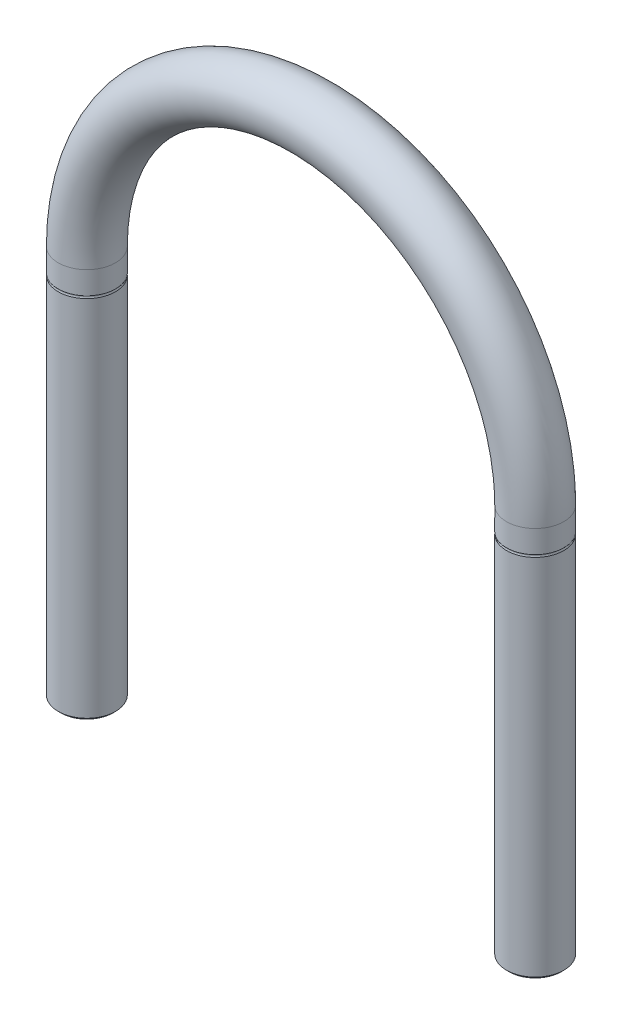
ISO-10303-21;
HEADER;
FILE_DESCRIPTION(('STEP AP214'),'2;1');
FILE_NAME('part.step','',(''),(''),'','','');
FILE_SCHEMA(('AUTOMOTIVE_DESIGN { 1 0 10303 214 1 1 1 1 }'));
ENDSEC;
DATA;
#1=APPLICATION_CONTEXT('core data for automotive mechanical design processes');
#2=APPLICATION_PROTOCOL_DEFINITION('international standard','automotive_design',2000,#1);
#3=PRODUCT_CONTEXT('',#1,'mechanical');
#4=PRODUCT('Part','Part','',(#3));
#5=PRODUCT_RELATED_PRODUCT_CATEGORY('part','',(#4));
#6=PRODUCT_DEFINITION_FORMATION('','',#4);
#7=PRODUCT_DEFINITION_CONTEXT('part definition',#1,'design');
#8=PRODUCT_DEFINITION('design','',#6,#7);
#9=PRODUCT_DEFINITION_SHAPE('','',#8);
#10=(LENGTH_UNIT() NAMED_UNIT(*) SI_UNIT(.MILLI.,.METRE.));
#11=(NAMED_UNIT(*) PLANE_ANGLE_UNIT() SI_UNIT($,.RADIAN.));
#12=(NAMED_UNIT(*) SI_UNIT($,.STERADIAN.) SOLID_ANGLE_UNIT());
#13=UNCERTAINTY_MEASURE_WITH_UNIT(LENGTH_MEASURE(1.E-05),#10,'distance_accuracy_value','');
#14=(GEOMETRIC_REPRESENTATION_CONTEXT(3) GLOBAL_UNCERTAINTY_ASSIGNED_CONTEXT((#13)) GLOBAL_UNIT_ASSIGNED_CONTEXT((#10,
#11,#12)) REPRESENTATION_CONTEXT('',''));
#15=CARTESIAN_POINT('',(0.,0.,0.));
#16=DIRECTION('',(0.,0.,1.));
#17=DIRECTION('',(1.,0.,0.));
#18=AXIS2_PLACEMENT_3D('',#15,#16,#17);
#19=CARTESIAN_POINT('',(0.,0.,0.));
#20=DIRECTION('',(0.,0.,-1.));
#21=DIRECTION('',(0.,1.,0.));
#22=AXIS2_PLACEMENT_3D('',#19,#20,#21);
#23=TOROIDAL_SURFACE('',#22,47.,6.);
#24=CARTESIAN_POINT('',(-47.,0.,0.));
#25=DIRECTION('',(0.,1.,0.));
#26=DIRECTION('',(-1.,0.,0.));
#27=AXIS2_PLACEMENT_3D('',#24,#25,#26);
#28=CIRCLE('',#27,6.);
#29=CARTESIAN_POINT('',(-41.,0.,0.));
#30=VERTEX_POINT('',#29);
#31=EDGE_CURVE('E60',#30,#30,#28,.T.);
#32=ORIENTED_EDGE('',*,*,#31,.T.);
#33=EDGE_LOOP('',(#32));
#34=FACE_BOUND('',#33,.T.);
#35=CARTESIAN_POINT('',(47.,0.,0.));
#36=DIRECTION('',(0.,1.,0.));
#37=DIRECTION('',(1.,0.,0.));
#38=AXIS2_PLACEMENT_3D('',#35,#36,#37);
#39=CIRCLE('',#38,6.);
#40=CARTESIAN_POINT('',(41.,0.,0.));
#41=VERTEX_POINT('',#40);
#42=EDGE_CURVE('E10',#41,#41,#39,.T.);
#43=ORIENTED_EDGE('',*,*,#42,.T.);
#44=EDGE_LOOP('',(#43));
#45=FACE_BOUND('',#44,.T.);
#46=ADVANCED_FACE('F15',(#34,#45),#23,.T.);
#47=CARTESIAN_POINT('',(47.,-82.,0.));
#48=DIRECTION('',(0.,-1.,0.));
#49=DIRECTION('',(-1.,0.,0.));
#50=AXIS2_PLACEMENT_3D('',#47,#48,#49);
#51=PLANE('',#50);
#52=CARTESIAN_POINT('',(47.,-82.,0.));
#53=DIRECTION('',(0.,-1.,0.));
#54=DIRECTION('',(1.,0.,0.));
#55=AXIS2_PLACEMENT_3D('',#52,#53,#54);
#56=CIRCLE('',#55,5.45875);
#57=CARTESIAN_POINT('',(52.45875,-82.,0.));
#58=VERTEX_POINT('',#57);
#59=EDGE_CURVE('E24',#58,#58,#56,.T.);
#60=ORIENTED_EDGE('',*,*,#59,.T.);
#61=EDGE_LOOP('',(#60));
#62=FACE_BOUND('',#61,.T.);
#63=ADVANCED_FACE('F84',(#62),#51,.T.);
#64=CARTESIAN_POINT('',(47.,-41.,0.));
#65=DIRECTION('',(0.,-1.,0.));
#66=DIRECTION('',(1.,0.,0.));
#67=AXIS2_PLACEMENT_3D('',#64,#65,#66);
#68=CYLINDRICAL_SURFACE('',#67,6.);
#69=ORIENTED_EDGE('',*,*,#42,.F.);
#70=EDGE_LOOP('',(#69));
#71=FACE_BOUND('',#70,.T.);
#72=CARTESIAN_POINT('',(47.,-4.75,0.));
#73=DIRECTION('',(0.,1.,0.));
#74=DIRECTION('',(1.,0.,0.));
#75=AXIS2_PLACEMENT_3D('',#72,#73,#74);
#76=CIRCLE('',#75,6.);
#77=CARTESIAN_POINT('',(53.,-4.75,0.));
#78=VERTEX_POINT('',#77);
#79=EDGE_CURVE('E52',#78,#78,#76,.T.);
#80=ORIENTED_EDGE('',*,*,#79,.T.);
#81=EDGE_LOOP('',(#80));
#82=FACE_BOUND('',#81,.T.);
#83=ADVANCED_FACE('F74',(#71,#82),#68,.T.);
#84=CARTESIAN_POINT('',(47.,-81.729375,0.));
#85=DIRECTION('',(0.,1.,0.));
#86=DIRECTION('',(1.,0.,0.));
#87=AXIS2_PLACEMENT_3D('',#84,#85,#86);
#88=CONICAL_SURFACE('',#87,5.729375,0.785398163397448);
#89=ORIENTED_EDGE('',*,*,#59,.F.);
#90=EDGE_LOOP('',(#89));
#91=FACE_BOUND('',#90,.T.);
#92=CARTESIAN_POINT('',(47.,-81.45875,0.));
#93=DIRECTION('',(0.,1.,0.));
#94=DIRECTION('',(1.,0.,0.));
#95=AXIS2_PLACEMENT_3D('',#92,#93,#94);
#96=CIRCLE('',#95,6.);
#97=CARTESIAN_POINT('',(53.,-81.45875,0.));
#98=VERTEX_POINT('',#97);
#99=EDGE_CURVE('E55',#98,#98,#96,.T.);
#100=ORIENTED_EDGE('',*,*,#99,.F.);
#101=EDGE_LOOP('',(#100));
#102=FACE_BOUND('',#101,.T.);
#103=ADVANCED_FACE('F72',(#91,#102),#88,.T.);
#104=CARTESIAN_POINT('',(47.,-41.,0.));
#105=DIRECTION('',(0.,-1.,0.));
#106=DIRECTION('',(1.,0.,0.));
#107=AXIS2_PLACEMENT_3D('',#104,#105,#106);
#108=CYLINDRICAL_SURFACE('',#107,6.);
#109=ORIENTED_EDGE('',*,*,#99,.T.);
#110=EDGE_LOOP('',(#109));
#111=FACE_BOUND('',#110,.T.);
#112=CARTESIAN_POINT('',(47.,-5.25,0.));
#113=DIRECTION('',(0.,-1.,0.));
#114=DIRECTION('',(1.,0.,0.));
#115=AXIS2_PLACEMENT_3D('',#112,#113,#114);
#116=CIRCLE('',#115,6.);
#117=CARTESIAN_POINT('',(53.,-5.25,0.));
#118=VERTEX_POINT('',#117);
#119=EDGE_CURVE('E56',#118,#118,#116,.T.);
#120=ORIENTED_EDGE('',*,*,#119,.T.);
#121=EDGE_LOOP('',(#120));
#122=FACE_BOUND('',#121,.T.);
#123=ADVANCED_FACE('F69',(#111,#122),#108,.T.);
#124=CARTESIAN_POINT('',(47.,-5.,0.));
#125=DIRECTION('',(0.,1.,0.));
#126=DIRECTION('',(0.,0.,1.));
#127=AXIS2_PLACEMENT_3D('',#124,#125,#126);
#128=TOROIDAL_SURFACE('',#127,6.43301270189222,0.5);
#129=ORIENTED_EDGE('',*,*,#79,.F.);
#130=EDGE_LOOP('',(#129));
#131=FACE_BOUND('',#130,.T.);
#132=ORIENTED_EDGE('',*,*,#119,.F.);
#133=EDGE_LOOP('',(#132));
#134=FACE_BOUND('',#133,.T.);
#135=ADVANCED_FACE('F82',(#131,#134),#128,.F.);
#136=CARTESIAN_POINT('',(-47.,-82.,0.));
#137=DIRECTION('',(0.,-1.,0.));
#138=DIRECTION('',(-1.,0.,0.));
#139=AXIS2_PLACEMENT_3D('',#136,#137,#138);
#140=PLANE('',#139);
#141=CARTESIAN_POINT('',(-47.,-82.,0.));
#142=DIRECTION('',(0.,-1.,0.));
#143=DIRECTION('',(1.,0.,0.));
#144=AXIS2_PLACEMENT_3D('',#141,#142,#143);
#145=CIRCLE('',#144,5.45875);
#146=CARTESIAN_POINT('',(-41.54125,-82.,0.));
#147=VERTEX_POINT('',#146);
#148=EDGE_CURVE('E62',#147,#147,#145,.T.);
#149=ORIENTED_EDGE('',*,*,#148,.T.);
#150=EDGE_LOOP('',(#149));
#151=FACE_BOUND('',#150,.T.);
#152=ADVANCED_FACE('F117',(#151),#140,.T.);
#153=CARTESIAN_POINT('',(-47.,-41.,0.));
#154=DIRECTION('',(0.,-1.,0.));
#155=DIRECTION('',(1.,0.,0.));
#156=AXIS2_PLACEMENT_3D('',#153,#154,#155);
#157=CYLINDRICAL_SURFACE('',#156,6.);
#158=ORIENTED_EDGE('',*,*,#31,.F.);
#159=EDGE_LOOP('',(#158));
#160=FACE_BOUND('',#159,.T.);
#161=CARTESIAN_POINT('',(-47.,-4.75,0.));
#162=DIRECTION('',(0.,1.,0.));
#163=DIRECTION('',(1.,0.,0.));
#164=AXIS2_PLACEMENT_3D('',#161,#162,#163);
#165=CIRCLE('',#164,6.);
#166=CARTESIAN_POINT('',(-41.,-4.75,0.));
#167=VERTEX_POINT('',#166);
#168=EDGE_CURVE('E41',#167,#167,#165,.T.);
#169=ORIENTED_EDGE('',*,*,#168,.T.);
#170=EDGE_LOOP('',(#169));
#171=FACE_BOUND('',#170,.T.);
#172=ADVANCED_FACE('F110',(#160,#171),#157,.T.);
#173=CARTESIAN_POINT('',(-47.,-81.729375,0.));
#174=DIRECTION('',(0.,1.,0.));
#175=DIRECTION('',(1.,0.,0.));
#176=AXIS2_PLACEMENT_3D('',#173,#174,#175);
#177=CONICAL_SURFACE('',#176,5.729375,0.785398163397448);
#178=ORIENTED_EDGE('',*,*,#148,.F.);
#179=EDGE_LOOP('',(#178));
#180=FACE_BOUND('',#179,.T.);
#181=CARTESIAN_POINT('',(-47.,-81.45875,0.));
#182=DIRECTION('',(0.,1.,0.));
#183=DIRECTION('',(1.,0.,0.));
#184=AXIS2_PLACEMENT_3D('',#181,#182,#183);
#185=CIRCLE('',#184,6.);
#186=CARTESIAN_POINT('',(-41.,-81.45875,0.));
#187=VERTEX_POINT('',#186);
#188=EDGE_CURVE('E50',#187,#187,#185,.T.);
#189=ORIENTED_EDGE('',*,*,#188,.F.);
#190=EDGE_LOOP('',(#189));
#191=FACE_BOUND('',#190,.T.);
#192=ADVANCED_FACE('F105',(#180,#191),#177,.T.);
#193=CARTESIAN_POINT('',(-47.,-41.,0.));
#194=DIRECTION('',(0.,-1.,0.));
#195=DIRECTION('',(1.,0.,0.));
#196=AXIS2_PLACEMENT_3D('',#193,#194,#195);
#197=CYLINDRICAL_SURFACE('',#196,6.);
#198=ORIENTED_EDGE('',*,*,#188,.T.);
#199=EDGE_LOOP('',(#198));
#200=FACE_BOUND('',#199,.T.);
#201=CARTESIAN_POINT('',(-47.,-5.25,0.));
#202=DIRECTION('',(0.,-1.,0.));
#203=DIRECTION('',(1.,0.,0.));
#204=AXIS2_PLACEMENT_3D('',#201,#202,#203);
#205=CIRCLE('',#204,6.);
#206=CARTESIAN_POINT('',(-41.,-5.25,0.));
#207=VERTEX_POINT('',#206);
#208=EDGE_CURVE('E47',#207,#207,#205,.T.);
#209=ORIENTED_EDGE('',*,*,#208,.T.);
#210=EDGE_LOOP('',(#209));
#211=FACE_BOUND('',#210,.T.);
#212=ADVANCED_FACE('F17',(#200,#211),#197,.T.);
#213=CARTESIAN_POINT('',(-47.,-5.,0.));
#214=DIRECTION('',(0.,1.,0.));
#215=DIRECTION('',(0.,0.,1.));
#216=AXIS2_PLACEMENT_3D('',#213,#214,#215);
#217=TOROIDAL_SURFACE('',#216,6.43301270189222,0.5);
#218=ORIENTED_EDGE('',*,*,#168,.F.);
#219=EDGE_LOOP('',(#218));
#220=FACE_BOUND('',#219,.T.);
#221=ORIENTED_EDGE('',*,*,#208,.F.);
#222=EDGE_LOOP('',(#221));
#223=FACE_BOUND('',#222,.T.);
#224=ADVANCED_FACE('F99',(#220,#223),#217,.F.);
#225=CLOSED_SHELL('',(#46,#63,#83,#103,#123,#135,#152,#172,#192,#212,#224));
#226=MANIFOLD_SOLID_BREP('B1',#225);
#227=ADVANCED_BREP_SHAPE_REPRESENTATION('',(#18,#226),#14);
#228=SHAPE_DEFINITION_REPRESENTATION(#9,#227);
ENDSEC;
END-ISO-10303-21;
